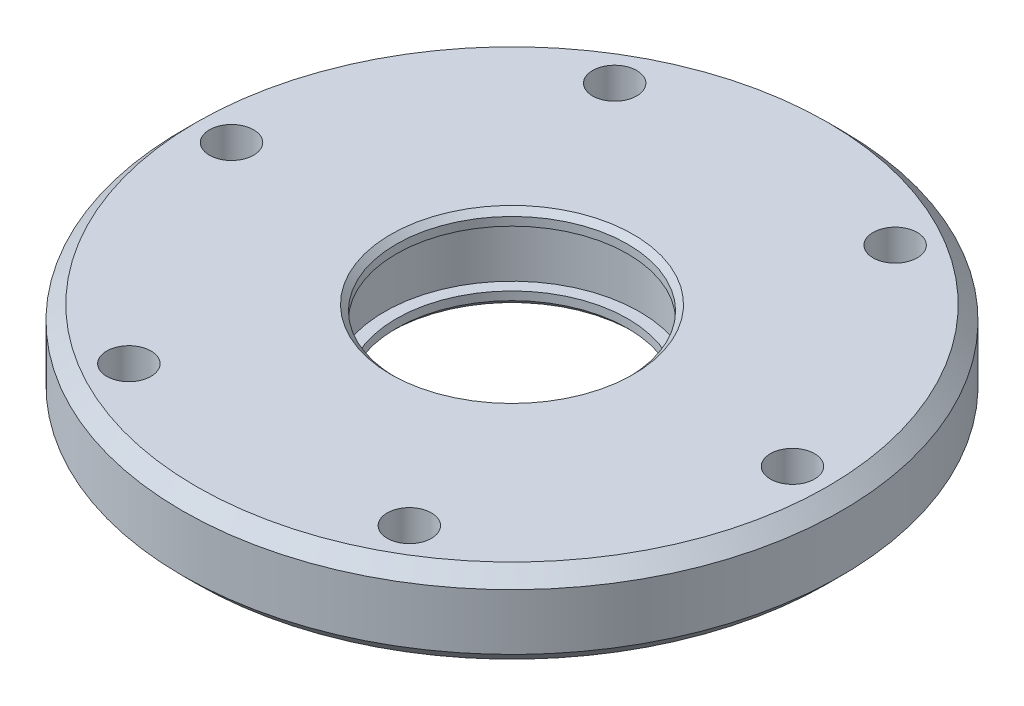
ISO-10303-21;
HEADER;
FILE_DESCRIPTION(('STEP AP214'),'2;1');
FILE_NAME('part.step','',(''),(''),'','','');
FILE_SCHEMA(('AUTOMOTIVE_DESIGN { 1 0 10303 214 1 1 1 1 }'));
ENDSEC;
DATA;
#1=APPLICATION_CONTEXT('core data for automotive mechanical design processes');
#2=APPLICATION_PROTOCOL_DEFINITION('international standard','automotive_design',2000,#1);
#3=PRODUCT_CONTEXT('',#1,'mechanical');
#4=PRODUCT('Part','Part','',(#3));
#5=PRODUCT_RELATED_PRODUCT_CATEGORY('part','',(#4));
#6=PRODUCT_DEFINITION_FORMATION('','',#4);
#7=PRODUCT_DEFINITION_CONTEXT('part definition',#1,'design');
#8=PRODUCT_DEFINITION('design','',#6,#7);
#9=PRODUCT_DEFINITION_SHAPE('','',#8);
#10=(LENGTH_UNIT() NAMED_UNIT(*) SI_UNIT(.MILLI.,.METRE.));
#11=(NAMED_UNIT(*) PLANE_ANGLE_UNIT() SI_UNIT($,.RADIAN.));
#12=(NAMED_UNIT(*) SI_UNIT($,.STERADIAN.) SOLID_ANGLE_UNIT());
#13=UNCERTAINTY_MEASURE_WITH_UNIT(LENGTH_MEASURE(1.E-05),#10,'distance_accuracy_value','');
#14=(GEOMETRIC_REPRESENTATION_CONTEXT(3) GLOBAL_UNCERTAINTY_ASSIGNED_CONTEXT((#13)) GLOBAL_UNIT_ASSIGNED_CONTEXT((#10,
#11,#12)) REPRESENTATION_CONTEXT('',''));
#15=CARTESIAN_POINT('',(0.,0.,0.));
#16=DIRECTION('',(0.,0.,1.));
#17=DIRECTION('',(1.,0.,0.));
#18=AXIS2_PLACEMENT_3D('',#15,#16,#17);
#19=CARTESIAN_POINT('',(0.,3.,0.));
#20=DIRECTION('',(0.,-1.,0.));
#21=DIRECTION('',(0.,0.,-1.));
#22=AXIS2_PLACEMENT_3D('',#19,#20,#21);
#23=CYLINDRICAL_SURFACE('',#22,8.25);
#24=CARTESIAN_POINT('',(0.,-2.6,0.));
#25=DIRECTION('',(0.,1.,0.));
#26=DIRECTION('',(0.,0.,1.));
#27=AXIS2_PLACEMENT_3D('',#24,#25,#26);
#28=CIRCLE('',#27,8.25);
#29=CARTESIAN_POINT('',(0.,-2.6,8.25));
#30=VERTEX_POINT('',#29);
#31=EDGE_CURVE('E50',#30,#30,#28,.F.);
#32=ORIENTED_EDGE('',*,*,#31,.T.);
#33=EDGE_LOOP('',(#32));
#34=FACE_BOUND('',#33,.T.);
#35=CARTESIAN_POINT('',(0.,-2.,0.));
#36=DIRECTION('',(0.,1.,0.));
#37=DIRECTION('',(0.,0.,1.));
#38=AXIS2_PLACEMENT_3D('',#35,#36,#37);
#39=CIRCLE('',#38,8.25);
#40=CARTESIAN_POINT('',(0.,-2.,8.25));
#41=VERTEX_POINT('',#40);
#42=EDGE_CURVE('E75',#41,#41,#39,.T.);
#43=ORIENTED_EDGE('',*,*,#42,.T.);
#44=EDGE_LOOP('',(#43));
#45=FACE_BOUND('',#44,.T.);
#46=ADVANCED_FACE('F38',(#34,#45),#23,.F.);
#47=CARTESIAN_POINT('',(0.,3.,0.));
#48=DIRECTION('',(0.,1.,0.));
#49=DIRECTION('',(0.,0.,1.));
#50=AXIS2_PLACEMENT_3D('',#47,#48,#49);
#51=PLANE('',#50);
#52=CARTESIAN_POINT('',(0.,3.,0.));
#53=DIRECTION('',(0.,1.,0.));
#54=DIRECTION('',(0.,0.,1.));
#55=AXIS2_PLACEMENT_3D('',#52,#53,#54);
#56=CIRCLE('',#55,8.65);
#57=CARTESIAN_POINT('',(0.,3.,8.65));
#58=VERTEX_POINT('',#57);
#59=EDGE_CURVE('E10',#58,#58,#56,.F.);
#60=ORIENTED_EDGE('',*,*,#59,.T.);
#61=EDGE_LOOP('',(#60));
#62=FACE_BOUND('',#61,.T.);
#63=CARTESIAN_POINT('',(0.,3.,0.));
#64=DIRECTION('',(0.,1.,0.));
#65=DIRECTION('',(0.,0.,1.));
#66=AXIS2_PLACEMENT_3D('',#63,#64,#65);
#67=CIRCLE('',#66,22.5);
#68=CARTESIAN_POINT('',(0.,3.,22.5));
#69=VERTEX_POINT('',#68);
#70=EDGE_CURVE('E59',#69,#69,#67,.T.);
#71=ORIENTED_EDGE('',*,*,#70,.T.);
#72=EDGE_LOOP('',(#71));
#73=FACE_BOUND('',#72,.T.);
#74=CARTESIAN_POINT('',(-10.,3.,-17.3205080756888));
#75=DIRECTION('',(0.,1.,0.));
#76=DIRECTION('',(0.,0.,1.));
#77=AXIS2_PLACEMENT_3D('',#74,#75,#76);
#78=CIRCLE('',#77,1.575);
#79=CARTESIAN_POINT('',(-10.,3.,-15.7455080756888));
#80=VERTEX_POINT('',#79);
#81=EDGE_CURVE('E94',#80,#80,#78,.T.);
#82=ORIENTED_EDGE('',*,*,#81,.F.);
#83=EDGE_LOOP('',(#82));
#84=FACE_BOUND('',#83,.T.);
#85=CARTESIAN_POINT('',(-10.,3.,17.3205080756888));
#86=DIRECTION('',(0.,1.,0.));
#87=DIRECTION('',(0.,0.,1.));
#88=AXIS2_PLACEMENT_3D('',#85,#86,#87);
#89=CIRCLE('',#88,1.575);
#90=CARTESIAN_POINT('',(-10.,3.,18.8955080756888));
#91=VERTEX_POINT('',#90);
#92=EDGE_CURVE('E88',#91,#91,#89,.T.);
#93=ORIENTED_EDGE('',*,*,#92,.F.);
#94=EDGE_LOOP('',(#93));
#95=FACE_BOUND('',#94,.T.);
#96=CARTESIAN_POINT('',(20.,3.,0.));
#97=DIRECTION('',(0.,1.,0.));
#98=DIRECTION('',(0.,0.,1.));
#99=AXIS2_PLACEMENT_3D('',#96,#97,#98);
#100=CIRCLE('',#99,1.575);
#101=CARTESIAN_POINT('',(20.,3.,1.575));
#102=VERTEX_POINT('',#101);
#103=EDGE_CURVE('E74',#102,#102,#100,.T.);
#104=ORIENTED_EDGE('',*,*,#103,.F.);
#105=EDGE_LOOP('',(#104));
#106=FACE_BOUND('',#105,.T.);
#107=CARTESIAN_POINT('',(10.,3.,17.3205080756888));
#108=DIRECTION('',(0.,1.,0.));
#109=DIRECTION('',(0.,0.,1.));
#110=AXIS2_PLACEMENT_3D('',#107,#108,#109);
#111=CIRCLE('',#110,1.575);
#112=CARTESIAN_POINT('',(10.,3.,18.8955080756888));
#113=VERTEX_POINT('',#112);
#114=EDGE_CURVE('E85',#113,#113,#111,.T.);
#115=ORIENTED_EDGE('',*,*,#114,.F.);
#116=EDGE_LOOP('',(#115));
#117=FACE_BOUND('',#116,.T.);
#118=CARTESIAN_POINT('',(-20.,3.,0.));
#119=DIRECTION('',(0.,1.,0.));
#120=DIRECTION('',(0.,0.,1.));
#121=AXIS2_PLACEMENT_3D('',#118,#119,#120);
#122=CIRCLE('',#121,1.575);
#123=CARTESIAN_POINT('',(-20.,3.,1.575));
#124=VERTEX_POINT('',#123);
#125=EDGE_CURVE('E91',#124,#124,#122,.T.);
#126=ORIENTED_EDGE('',*,*,#125,.F.);
#127=EDGE_LOOP('',(#126));
#128=FACE_BOUND('',#127,.T.);
#129=CARTESIAN_POINT('',(9.99999999999999,3.,-17.3205080756888));
#130=DIRECTION('',(0.,1.,0.));
#131=DIRECTION('',(0.,0.,1.));
#132=AXIS2_PLACEMENT_3D('',#129,#130,#131);
#133=CIRCLE('',#132,1.575);
#134=CARTESIAN_POINT('',(9.99999999999999,3.,-15.7455080756888));
#135=VERTEX_POINT('',#134);
#136=EDGE_CURVE('E78',#135,#135,#133,.T.);
#137=ORIENTED_EDGE('',*,*,#136,.F.);
#138=EDGE_LOOP('',(#137));
#139=FACE_BOUND('',#138,.T.);
#140=ADVANCED_FACE('F130',(#62,#73,#84,#95,#106,#117,#128,#139),#51,.T.);
#141=CARTESIAN_POINT('',(0.,-3.,0.));
#142=DIRECTION('',(0.,1.,0.));
#143=DIRECTION('',(0.,0.,1.));
#144=AXIS2_PLACEMENT_3D('',#141,#142,#143);
#145=PLANE('',#144);
#146=CARTESIAN_POINT('',(0.,-3.,0.));
#147=DIRECTION('',(0.,1.,0.));
#148=DIRECTION('',(0.,0.,1.));
#149=AXIS2_PLACEMENT_3D('',#146,#147,#148);
#150=CIRCLE('',#149,8.65);
#151=CARTESIAN_POINT('',(0.,-3.,8.65));
#152=VERTEX_POINT('',#151);
#153=EDGE_CURVE('E54',#152,#152,#150,.T.);
#154=ORIENTED_EDGE('',*,*,#153,.T.);
#155=EDGE_LOOP('',(#154));
#156=FACE_BOUND('',#155,.T.);
#157=CARTESIAN_POINT('',(0.,-3.,0.));
#158=DIRECTION('',(0.,1.,0.));
#159=DIRECTION('',(0.,0.,1.));
#160=AXIS2_PLACEMENT_3D('',#157,#158,#159);
#161=CIRCLE('',#160,22.5);
#162=CARTESIAN_POINT('',(0.,-3.,22.5));
#163=VERTEX_POINT('',#162);
#164=EDGE_CURVE('E62',#163,#163,#161,.F.);
#165=ORIENTED_EDGE('',*,*,#164,.T.);
#166=EDGE_LOOP('',(#165));
#167=FACE_BOUND('',#166,.T.);
#168=ADVANCED_FACE('F133',(#156,#167),#145,.F.);
#169=CARTESIAN_POINT('',(0.,3.,0.));
#170=DIRECTION('',(0.,-1.,0.));
#171=DIRECTION('',(0.,0.,-1.));
#172=AXIS2_PLACEMENT_3D('',#169,#170,#171);
#173=CYLINDRICAL_SURFACE('',#172,23.5);
#174=CARTESIAN_POINT('',(0.,-1.99999999999999,0.));
#175=DIRECTION('',(0.,1.,0.));
#176=DIRECTION('',(0.,0.,1.));
#177=AXIS2_PLACEMENT_3D('',#174,#175,#176);
#178=CIRCLE('',#177,23.5);
#179=CARTESIAN_POINT('',(0.,-1.99999999999999,23.5));
#180=VERTEX_POINT('',#179);
#181=EDGE_CURVE('E65',#180,#180,#178,.T.);
#182=ORIENTED_EDGE('',*,*,#181,.T.);
#183=EDGE_LOOP('',(#182));
#184=FACE_BOUND('',#183,.T.);
#185=CARTESIAN_POINT('',(0.,2.,0.));
#186=DIRECTION('',(0.,1.,0.));
#187=DIRECTION('',(0.,0.,1.));
#188=AXIS2_PLACEMENT_3D('',#185,#186,#187);
#189=CIRCLE('',#188,23.5);
#190=CARTESIAN_POINT('',(0.,2.,23.5));
#191=VERTEX_POINT('',#190);
#192=EDGE_CURVE('E68',#191,#191,#189,.F.);
#193=ORIENTED_EDGE('',*,*,#192,.T.);
#194=EDGE_LOOP('',(#193));
#195=FACE_BOUND('',#194,.T.);
#196=ADVANCED_FACE('F174',(#184,#195),#173,.T.);
#197=CARTESIAN_POINT('',(20.,3.,0.));
#198=DIRECTION('',(0.,-1.,0.));
#199=DIRECTION('',(0.,0.,-1.));
#200=AXIS2_PLACEMENT_3D('',#197,#198,#199);
#201=CYLINDRICAL_SURFACE('',#200,1.575);
#202=CARTESIAN_POINT('',(20.,-2.,0.));
#203=DIRECTION('',(0.,1.,0.));
#204=DIRECTION('',(0.,0.,1.));
#205=AXIS2_PLACEMENT_3D('',#202,#203,#204);
#206=CIRCLE('',#205,1.575);
#207=CARTESIAN_POINT('',(20.,-2.,1.575));
#208=VERTEX_POINT('',#207);
#209=EDGE_CURVE('E102',#208,#208,#206,.T.);
#210=ORIENTED_EDGE('',*,*,#209,.F.);
#211=EDGE_LOOP('',(#210));
#212=FACE_BOUND('',#211,.T.);
#213=ORIENTED_EDGE('',*,*,#103,.T.);
#214=EDGE_LOOP('',(#213));
#215=FACE_BOUND('',#214,.T.);
#216=ADVANCED_FACE('F167',(#212,#215),#201,.F.);
#217=CARTESIAN_POINT('',(0.,2.6,0.));
#218=DIRECTION('',(0.,1.,0.));
#219=DIRECTION('',(0.,0.,1.));
#220=AXIS2_PLACEMENT_3D('',#217,#218,#219);
#221=CIRCLE('',#220,8.25);
#222=CARTESIAN_POINT('',(0.,2.6,8.25));
#223=VERTEX_POINT('',#222);
#224=EDGE_CURVE('E46',#223,#223,#221,.T.);
#225=ORIENTED_EDGE('',*,*,#224,.T.);
#226=EDGE_LOOP('',(#225));
#227=FACE_BOUND('',#226,.T.);
#228=CARTESIAN_POINT('',(0.,2.,0.));
#229=DIRECTION('',(0.,1.,0.));
#230=DIRECTION('',(0.,0.,1.));
#231=AXIS2_PLACEMENT_3D('',#228,#229,#230);
#232=CIRCLE('',#231,8.25);
#233=CARTESIAN_POINT('',(0.,2.,8.25));
#234=VERTEX_POINT('',#233);
#235=EDGE_CURVE('E79',#234,#234,#232,.T.);
#236=ORIENTED_EDGE('',*,*,#235,.F.);
#237=EDGE_LOOP('',(#236));
#238=FACE_BOUND('',#237,.T.);
#239=ADVANCED_FACE('F159',(#227,#238),#23,.F.);
#240=CARTESIAN_POINT('',(10.,3.,17.3205080756888));
#241=DIRECTION('',(0.,-1.,0.));
#242=DIRECTION('',(0.,0.,-1.));
#243=AXIS2_PLACEMENT_3D('',#240,#241,#242);
#244=CYLINDRICAL_SURFACE('',#243,1.575);
#245=CARTESIAN_POINT('',(10.,-2.,17.3205080756888));
#246=DIRECTION('',(0.,1.,0.));
#247=DIRECTION('',(0.,0.,1.));
#248=AXIS2_PLACEMENT_3D('',#245,#246,#247);
#249=CIRCLE('',#248,1.575);
#250=CARTESIAN_POINT('',(10.,-2.,18.8955080756888));
#251=VERTEX_POINT('',#250);
#252=EDGE_CURVE('E107',#251,#251,#249,.T.);
#253=ORIENTED_EDGE('',*,*,#252,.F.);
#254=EDGE_LOOP('',(#253));
#255=FACE_BOUND('',#254,.T.);
#256=ORIENTED_EDGE('',*,*,#114,.T.);
#257=EDGE_LOOP('',(#256));
#258=FACE_BOUND('',#257,.T.);
#259=ADVANCED_FACE('F166',(#255,#258),#244,.F.);
#260=CARTESIAN_POINT('',(-10.,3.,17.3205080756888));
#261=DIRECTION('',(0.,-1.,0.));
#262=DIRECTION('',(0.,0.,-1.));
#263=AXIS2_PLACEMENT_3D('',#260,#261,#262);
#264=CYLINDRICAL_SURFACE('',#263,1.575);
#265=CARTESIAN_POINT('',(-10.,-2.,17.3205080756888));
#266=DIRECTION('',(0.,1.,0.));
#267=DIRECTION('',(0.,0.,1.));
#268=AXIS2_PLACEMENT_3D('',#265,#266,#267);
#269=CIRCLE('',#268,1.575);
#270=CARTESIAN_POINT('',(-10.,-2.,18.8955080756888));
#271=VERTEX_POINT('',#270);
#272=EDGE_CURVE('E110',#271,#271,#269,.T.);
#273=ORIENTED_EDGE('',*,*,#272,.F.);
#274=EDGE_LOOP('',(#273));
#275=FACE_BOUND('',#274,.T.);
#276=ORIENTED_EDGE('',*,*,#92,.T.);
#277=EDGE_LOOP('',(#276));
#278=FACE_BOUND('',#277,.T.);
#279=ADVANCED_FACE('F172',(#275,#278),#264,.F.);
#280=CARTESIAN_POINT('',(-20.,3.,0.));
#281=DIRECTION('',(0.,-1.,0.));
#282=DIRECTION('',(0.,0.,-1.));
#283=AXIS2_PLACEMENT_3D('',#280,#281,#282);
#284=CYLINDRICAL_SURFACE('',#283,1.575);
#285=CARTESIAN_POINT('',(-20.,-2.,0.));
#286=DIRECTION('',(0.,1.,0.));
#287=DIRECTION('',(0.,0.,1.));
#288=AXIS2_PLACEMENT_3D('',#285,#286,#287);
#289=CIRCLE('',#288,1.575);
#290=CARTESIAN_POINT('',(-20.,-2.,1.575));
#291=VERTEX_POINT('',#290);
#292=EDGE_CURVE('E113',#291,#291,#289,.T.);
#293=ORIENTED_EDGE('',*,*,#292,.F.);
#294=EDGE_LOOP('',(#293));
#295=FACE_BOUND('',#294,.T.);
#296=ORIENTED_EDGE('',*,*,#125,.T.);
#297=EDGE_LOOP('',(#296));
#298=FACE_BOUND('',#297,.T.);
#299=ADVANCED_FACE('F126',(#295,#298),#284,.F.);
#300=CARTESIAN_POINT('',(-10.,3.,-17.3205080756888));
#301=DIRECTION('',(0.,-1.,0.));
#302=DIRECTION('',(0.,0.,-1.));
#303=AXIS2_PLACEMENT_3D('',#300,#301,#302);
#304=CYLINDRICAL_SURFACE('',#303,1.575);
#305=CARTESIAN_POINT('',(-10.,-2.,-17.3205080756888));
#306=DIRECTION('',(0.,1.,0.));
#307=DIRECTION('',(0.,0.,1.));
#308=AXIS2_PLACEMENT_3D('',#305,#306,#307);
#309=CIRCLE('',#308,1.575);
#310=CARTESIAN_POINT('',(-10.,-2.,-15.7455080756888));
#311=VERTEX_POINT('',#310);
#312=EDGE_CURVE('E116',#311,#311,#309,.T.);
#313=ORIENTED_EDGE('',*,*,#312,.F.);
#314=EDGE_LOOP('',(#313));
#315=FACE_BOUND('',#314,.T.);
#316=ORIENTED_EDGE('',*,*,#81,.T.);
#317=EDGE_LOOP('',(#316));
#318=FACE_BOUND('',#317,.T.);
#319=ADVANCED_FACE('F122',(#315,#318),#304,.F.);
#320=CARTESIAN_POINT('',(9.99999999999999,3.,-17.3205080756888));
#321=DIRECTION('',(0.,-1.,0.));
#322=DIRECTION('',(0.,0.,-1.));
#323=AXIS2_PLACEMENT_3D('',#320,#321,#322);
#324=CYLINDRICAL_SURFACE('',#323,1.575);
#325=CARTESIAN_POINT('',(9.99999999999999,-2.,-17.3205080756888));
#326=DIRECTION('',(0.,1.,0.));
#327=DIRECTION('',(0.,0.,1.));
#328=AXIS2_PLACEMENT_3D('',#325,#326,#327);
#329=CIRCLE('',#328,1.575);
#330=CARTESIAN_POINT('',(9.99999999999999,-2.,-15.7455080756888));
#331=VERTEX_POINT('',#330);
#332=EDGE_CURVE('E71',#331,#331,#329,.T.);
#333=ORIENTED_EDGE('',*,*,#332,.F.);
#334=EDGE_LOOP('',(#333));
#335=FACE_BOUND('',#334,.T.);
#336=ORIENTED_EDGE('',*,*,#136,.T.);
#337=EDGE_LOOP('',(#336));
#338=FACE_BOUND('',#337,.T.);
#339=ADVANCED_FACE('F125',(#335,#338),#324,.F.);
#340=CARTESIAN_POINT('',(0.,-2.,0.));
#341=DIRECTION('',(0.,1.,0.));
#342=DIRECTION('',(0.,0.,1.));
#343=AXIS2_PLACEMENT_3D('',#340,#341,#342);
#344=CYLINDRICAL_SURFACE('',#343,9.1);
#345=CARTESIAN_POINT('',(0.,-2.,0.));
#346=DIRECTION('',(0.,1.,0.));
#347=DIRECTION('',(0.,0.,1.));
#348=AXIS2_PLACEMENT_3D('',#345,#346,#347);
#349=CIRCLE('',#348,9.1);
#350=CARTESIAN_POINT('',(0.,-2.,9.1));
#351=VERTEX_POINT('',#350);
#352=EDGE_CURVE('E82',#351,#351,#349,.T.);
#353=ORIENTED_EDGE('',*,*,#352,.F.);
#354=EDGE_LOOP('',(#353));
#355=FACE_BOUND('',#354,.T.);
#356=CARTESIAN_POINT('',(0.,2.,0.));
#357=DIRECTION('',(0.,1.,0.));
#358=DIRECTION('',(0.,0.,1.));
#359=AXIS2_PLACEMENT_3D('',#356,#357,#358);
#360=CIRCLE('',#359,9.1);
#361=CARTESIAN_POINT('',(0.,2.,9.1));
#362=VERTEX_POINT('',#361);
#363=EDGE_CURVE('E99',#362,#362,#360,.T.);
#364=ORIENTED_EDGE('',*,*,#363,.T.);
#365=EDGE_LOOP('',(#364));
#366=FACE_BOUND('',#365,.T.);
#367=ADVANCED_FACE('F146',(#355,#366),#344,.F.);
#368=CARTESIAN_POINT('',(0.,-2.,0.));
#369=DIRECTION('',(0.,1.,0.));
#370=DIRECTION('',(0.,0.,1.));
#371=AXIS2_PLACEMENT_3D('',#368,#369,#370);
#372=PLANE('',#371);
#373=ORIENTED_EDGE('',*,*,#42,.F.);
#374=EDGE_LOOP('',(#373));
#375=FACE_BOUND('',#374,.T.);
#376=ORIENTED_EDGE('',*,*,#352,.T.);
#377=EDGE_LOOP('',(#376));
#378=FACE_BOUND('',#377,.T.);
#379=ADVANCED_FACE('F152',(#375,#378),#372,.T.);
#380=CARTESIAN_POINT('',(0.,2.,0.));
#381=DIRECTION('',(0.,1.,0.));
#382=DIRECTION('',(0.,0.,1.));
#383=AXIS2_PLACEMENT_3D('',#380,#381,#382);
#384=PLANE('',#383);
#385=ORIENTED_EDGE('',*,*,#235,.T.);
#386=EDGE_LOOP('',(#385));
#387=FACE_BOUND('',#386,.T.);
#388=ORIENTED_EDGE('',*,*,#363,.F.);
#389=EDGE_LOOP('',(#388));
#390=FACE_BOUND('',#389,.T.);
#391=ADVANCED_FACE('F179',(#387,#390),#384,.F.);
#392=CARTESIAN_POINT('',(0.,-2.,0.));
#393=DIRECTION('',(0.,1.,0.));
#394=DIRECTION('',(0.,0.,1.));
#395=AXIS2_PLACEMENT_3D('',#392,#393,#394);
#396=PLANE('',#395);
#397=ORIENTED_EDGE('',*,*,#332,.T.);
#398=EDGE_LOOP('',(#397));
#399=FACE_BOUND('',#398,.T.);
#400=ADVANCED_FACE('F182',(#399),#396,.T.);
#401=ORIENTED_EDGE('',*,*,#312,.T.);
#402=EDGE_LOOP('',(#401));
#403=FACE_BOUND('',#402,.T.);
#404=ADVANCED_FACE('F120',(#403),#396,.T.);
#405=ORIENTED_EDGE('',*,*,#292,.T.);
#406=EDGE_LOOP('',(#405));
#407=FACE_BOUND('',#406,.T.);
#408=ADVANCED_FACE('F213',(#407),#396,.T.);
#409=ORIENTED_EDGE('',*,*,#272,.T.);
#410=EDGE_LOOP('',(#409));
#411=FACE_BOUND('',#410,.T.);
#412=ADVANCED_FACE('F206',(#411),#396,.T.);
#413=ORIENTED_EDGE('',*,*,#252,.T.);
#414=EDGE_LOOP('',(#413));
#415=FACE_BOUND('',#414,.T.);
#416=ADVANCED_FACE('F197',(#415),#396,.T.);
#417=ORIENTED_EDGE('',*,*,#209,.T.);
#418=EDGE_LOOP('',(#417));
#419=FACE_BOUND('',#418,.T.);
#420=ADVANCED_FACE('F192',(#419),#396,.T.);
#421=CARTESIAN_POINT('',(0.,-1.99999999999999,0.));
#422=DIRECTION('',(0.,1.,0.));
#423=DIRECTION('',(0.,0.,1.));
#424=AXIS2_PLACEMENT_3D('',#421,#422,#423);
#425=CONICAL_SURFACE('',#424,23.5,0.785398163397452);
#426=ORIENTED_EDGE('',*,*,#164,.F.);
#427=EDGE_LOOP('',(#426));
#428=FACE_BOUND('',#427,.T.);
#429=ORIENTED_EDGE('',*,*,#181,.F.);
#430=EDGE_LOOP('',(#429));
#431=FACE_BOUND('',#430,.T.);
#432=ADVANCED_FACE('F196',(#428,#431),#425,.T.);
#433=CARTESIAN_POINT('',(0.,3.,0.));
#434=DIRECTION('',(0.,-1.,0.));
#435=DIRECTION('',(0.,0.,-1.));
#436=AXIS2_PLACEMENT_3D('',#433,#434,#435);
#437=CONICAL_SURFACE('',#436,22.5,0.78539816339745);
#438=ORIENTED_EDGE('',*,*,#192,.F.);
#439=EDGE_LOOP('',(#438));
#440=FACE_BOUND('',#439,.T.);
#441=ORIENTED_EDGE('',*,*,#70,.F.);
#442=EDGE_LOOP('',(#441));
#443=FACE_BOUND('',#442,.T.);
#444=ADVANCED_FACE('F203',(#440,#443),#437,.T.);
#445=CARTESIAN_POINT('',(0.,-3.,0.));
#446=DIRECTION('',(0.,-1.,0.));
#447=DIRECTION('',(0.,0.,-1.));
#448=AXIS2_PLACEMENT_3D('',#445,#446,#447);
#449=CONICAL_SURFACE('',#448,8.65,0.785398163397444);
#450=ORIENTED_EDGE('',*,*,#31,.F.);
#451=EDGE_LOOP('',(#450));
#452=FACE_BOUND('',#451,.T.);
#453=ORIENTED_EDGE('',*,*,#153,.F.);
#454=EDGE_LOOP('',(#453));
#455=FACE_BOUND('',#454,.T.);
#456=ADVANCED_FACE('F312',(#452,#455),#449,.F.);
#457=CARTESIAN_POINT('',(0.,2.6,0.));
#458=DIRECTION('',(0.,1.,0.));
#459=DIRECTION('',(0.,0.,1.));
#460=AXIS2_PLACEMENT_3D('',#457,#458,#459);
#461=CONICAL_SURFACE('',#460,8.25,0.78539816339745);
#462=ORIENTED_EDGE('',*,*,#59,.F.);
#463=EDGE_LOOP('',(#462));
#464=FACE_BOUND('',#463,.T.);
#465=ORIENTED_EDGE('',*,*,#224,.F.);
#466=EDGE_LOOP('',(#465));
#467=FACE_BOUND('',#466,.T.);
#468=ADVANCED_FACE('F41',(#464,#467),#461,.F.);
#469=CLOSED_SHELL('',(#46,#140,#168,#196,#216,#239,#259,#279,#299,#319,#339,#367,#379,#391,#400,
#404,#408,#412,#416,#420,#432,#444,#456,#468));
#470=MANIFOLD_SOLID_BREP('B2',#469);
#471=ADVANCED_BREP_SHAPE_REPRESENTATION('',(#18,#470),#14);
#472=SHAPE_DEFINITION_REPRESENTATION(#9,#471);
ENDSEC;
END-ISO-10303-21;
